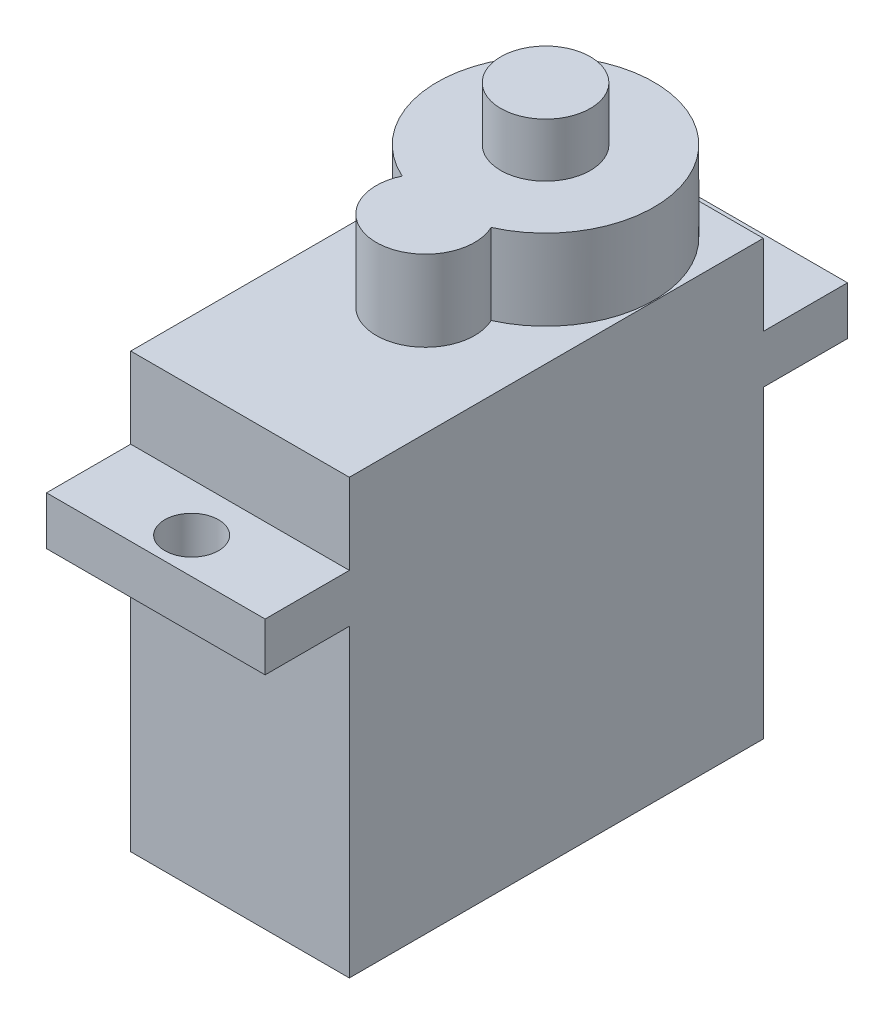
ISO-10303-21;
HEADER;
FILE_DESCRIPTION(('STEP AP214'),'2;1');
FILE_NAME('part.step','',(''),(''),'','','');
FILE_SCHEMA(('AUTOMOTIVE_DESIGN { 1 0 10303 214 1 1 1 1 }'));
ENDSEC;
DATA;
#1=APPLICATION_CONTEXT('core data for automotive mechanical design processes');
#2=APPLICATION_PROTOCOL_DEFINITION('international standard','automotive_design',2000,#1);
#3=PRODUCT_CONTEXT('',#1,'mechanical');
#4=PRODUCT('Part','Part','',(#3));
#5=PRODUCT_RELATED_PRODUCT_CATEGORY('part','',(#4));
#6=PRODUCT_DEFINITION_FORMATION('','',#4);
#7=PRODUCT_DEFINITION_CONTEXT('part definition',#1,'design');
#8=PRODUCT_DEFINITION('design','',#6,#7);
#9=PRODUCT_DEFINITION_SHAPE('','',#8);
#10=(LENGTH_UNIT() NAMED_UNIT(*) SI_UNIT(.MILLI.,.METRE.));
#11=(NAMED_UNIT(*) PLANE_ANGLE_UNIT() SI_UNIT($,.RADIAN.));
#12=(NAMED_UNIT(*) SI_UNIT($,.STERADIAN.) SOLID_ANGLE_UNIT());
#13=UNCERTAINTY_MEASURE_WITH_UNIT(LENGTH_MEASURE(1.E-05),#10,'distance_accuracy_value','');
#14=(GEOMETRIC_REPRESENTATION_CONTEXT(3) GLOBAL_UNCERTAINTY_ASSIGNED_CONTEXT((#13)) GLOBAL_UNIT_ASSIGNED_CONTEXT((#10,
#11,#12)) REPRESENTATION_CONTEXT('',''));
#15=CARTESIAN_POINT('',(0.,0.,0.));
#16=DIRECTION('',(0.,0.,1.));
#17=DIRECTION('',(1.,0.,0.));
#18=AXIS2_PLACEMENT_3D('',#15,#16,#17);
#19=CARTESIAN_POINT('',(-6.1,24.2,-11.55));
#20=DIRECTION('',(0.,0.,1.));
#21=DIRECTION('',(1.,0.,0.));
#22=AXIS2_PLACEMENT_3D('',#19,#20,#21);
#23=PLANE('',#22);
#24=DIRECTION('',(0.,-1.,0.));
#25=VECTOR('',#24,1.);
#26=CARTESIAN_POINT('',(6.1,24.2,-11.55));
#27=LINE('',#26,#25);
#28=CARTESIAN_POINT('',(6.1,24.2,-11.55));
#29=VERTEX_POINT('',#28);
#30=CARTESIAN_POINT('',(6.09999999999999,19.7,-11.55));
#31=VERTEX_POINT('',#30);
#32=EDGE_CURVE('E264',#29,#31,#27,.T.);
#33=ORIENTED_EDGE('',*,*,#32,.T.);
#34=DIRECTION('',(-1.,0.,0.));
#35=VECTOR('',#34,1.);
#36=CARTESIAN_POINT('',(-6.09999999999999,19.7,-11.55));
#37=LINE('',#36,#35);
#38=CARTESIAN_POINT('',(-6.09999999999999,19.7,-11.55));
#39=VERTEX_POINT('',#38);
#40=EDGE_CURVE('E179',#31,#39,#37,.T.);
#41=ORIENTED_EDGE('',*,*,#40,.T.);
#42=DIRECTION('',(0.,-1.,0.));
#43=VECTOR('',#42,1.);
#44=CARTESIAN_POINT('',(-6.1,24.2,-11.55));
#45=LINE('',#44,#43);
#46=CARTESIAN_POINT('',(-6.1,24.2,-11.55));
#47=VERTEX_POINT('',#46);
#48=EDGE_CURVE('E261',#47,#39,#45,.T.);
#49=ORIENTED_EDGE('',*,*,#48,.F.);
#50=DIRECTION('',(-1.,0.,0.));
#51=VECTOR('',#50,1.);
#52=CARTESIAN_POINT('',(-6.1,24.2,-11.55));
#53=LINE('',#52,#51);
#54=CARTESIAN_POINT('',(0.,24.2,-11.55));
#55=VERTEX_POINT('',#54);
#56=EDGE_CURVE('E234',#55,#47,#53,.T.);
#57=ORIENTED_EDGE('',*,*,#56,.F.);
#58=EDGE_CURVE('E236',#29,#55,#53,.T.);
#59=ORIENTED_EDGE('',*,*,#58,.F.);
#60=EDGE_LOOP('',(#33,#41,#49,#57,#59));
#61=FACE_BOUND('',#60,.T.);
#62=ADVANCED_FACE('F45',(#61),#23,.F.);
#63=CARTESIAN_POINT('',(-6.1,24.2,11.55));
#64=DIRECTION('',(0.,0.,-1.));
#65=DIRECTION('',(-1.,0.,0.));
#66=AXIS2_PLACEMENT_3D('',#63,#64,#65);
#67=PLANE('',#66);
#68=DIRECTION('',(1.,0.,0.));
#69=VECTOR('',#68,1.);
#70=CARTESIAN_POINT('',(-6.1,17.,11.55));
#71=LINE('',#70,#69);
#72=CARTESIAN_POINT('',(-6.1,17.,11.55));
#73=VERTEX_POINT('',#72);
#74=CARTESIAN_POINT('',(6.1,17.,11.55));
#75=VERTEX_POINT('',#74);
#76=EDGE_CURVE('E207',#73,#75,#71,.T.);
#77=ORIENTED_EDGE('',*,*,#76,.F.);
#78=DIRECTION('',(0.,-1.,0.));
#79=VECTOR('',#78,1.);
#80=CARTESIAN_POINT('',(-6.1,24.2,11.55));
#81=LINE('',#80,#79);
#82=CARTESIAN_POINT('',(-6.1,0.,11.55));
#83=VERTEX_POINT('',#82);
#84=EDGE_CURVE('E257',#73,#83,#81,.T.);
#85=ORIENTED_EDGE('',*,*,#84,.T.);
#86=DIRECTION('',(1.,0.,0.));
#87=VECTOR('',#86,1.);
#88=CARTESIAN_POINT('',(-6.1,0.,11.55));
#89=LINE('',#88,#87);
#90=CARTESIAN_POINT('',(6.1,0.,11.55));
#91=VERTEX_POINT('',#90);
#92=EDGE_CURVE('E235',#83,#91,#89,.T.);
#93=ORIENTED_EDGE('',*,*,#92,.T.);
#94=DIRECTION('',(0.,-1.,0.));
#95=VECTOR('',#94,1.);
#96=CARTESIAN_POINT('',(6.1,24.2,11.55));
#97=LINE('',#96,#95);
#98=EDGE_CURVE('E243',#75,#91,#97,.T.);
#99=ORIENTED_EDGE('',*,*,#98,.F.);
#100=EDGE_LOOP('',(#77,#85,#93,#99));
#101=FACE_BOUND('',#100,.T.);
#102=ADVANCED_FACE('F285',(#101),#67,.F.);
#103=DIRECTION('',(-1.,0.,0.));
#104=VECTOR('',#103,1.);
#105=CARTESIAN_POINT('',(-6.09999999999999,19.7,11.55));
#106=LINE('',#105,#104);
#107=CARTESIAN_POINT('',(6.1,19.7,11.55));
#108=VERTEX_POINT('',#107);
#109=CARTESIAN_POINT('',(-6.09999999999999,19.7,11.55));
#110=VERTEX_POINT('',#109);
#111=EDGE_CURVE('E214',#108,#110,#106,.T.);
#112=ORIENTED_EDGE('',*,*,#111,.F.);
#113=CARTESIAN_POINT('',(6.1,24.2,11.55));
#114=VERTEX_POINT('',#113);
#115=EDGE_CURVE('E254',#114,#108,#97,.T.);
#116=ORIENTED_EDGE('',*,*,#115,.F.);
#117=DIRECTION('',(1.,0.,0.));
#118=VECTOR('',#117,1.);
#119=CARTESIAN_POINT('',(-6.1,24.2,11.55));
#120=LINE('',#119,#118);
#121=CARTESIAN_POINT('',(-6.1,24.2,11.55));
#122=VERTEX_POINT('',#121);
#123=EDGE_CURVE('E241',#122,#114,#120,.T.);
#124=ORIENTED_EDGE('',*,*,#123,.F.);
#125=EDGE_CURVE('E258',#122,#110,#81,.T.);
#126=ORIENTED_EDGE('',*,*,#125,.T.);
#127=EDGE_LOOP('',(#112,#116,#124,#126));
#128=FACE_BOUND('',#127,.T.);
#129=ADVANCED_FACE('F309',(#128),#67,.F.);
#130=CARTESIAN_POINT('',(6.1,24.2,11.55));
#131=DIRECTION('',(-1.,0.,0.));
#132=DIRECTION('',(0.,0.,1.));
#133=AXIS2_PLACEMENT_3D('',#130,#131,#132);
#134=PLANE('',#133);
#135=DIRECTION('',(0.,0.,-1.));
#136=VECTOR('',#135,1.);
#137=CARTESIAN_POINT('',(6.1,0.,11.55));
#138=LINE('',#137,#136);
#139=CARTESIAN_POINT('',(6.1,0.,-11.55));
#140=VERTEX_POINT('',#139);
#141=EDGE_CURVE('E230',#91,#140,#138,.T.);
#142=ORIENTED_EDGE('',*,*,#141,.T.);
#143=CARTESIAN_POINT('',(6.1,17.,-11.55));
#144=VERTEX_POINT('',#143);
#145=EDGE_CURVE('E263',#144,#140,#27,.T.);
#146=ORIENTED_EDGE('',*,*,#145,.F.);
#147=DIRECTION('',(0.,0.,1.));
#148=VECTOR('',#147,1.);
#149=CARTESIAN_POINT('',(6.1,17.,-16.25));
#150=LINE('',#149,#148);
#151=CARTESIAN_POINT('',(6.1,17.,-16.25));
#152=VERTEX_POINT('',#151);
#153=EDGE_CURVE('E198',#152,#144,#150,.T.);
#154=ORIENTED_EDGE('',*,*,#153,.F.);
#155=DIRECTION('',(0.,1.,0.));
#156=VECTOR('',#155,1.);
#157=CARTESIAN_POINT('',(6.1,17.,-16.25));
#158=LINE('',#157,#156);
#159=CARTESIAN_POINT('',(6.09999999999999,19.7,-16.25));
#160=VERTEX_POINT('',#159);
#161=EDGE_CURVE('E175',#152,#160,#158,.T.);
#162=ORIENTED_EDGE('',*,*,#161,.T.);
#163=DIRECTION('',(0.,0.,1.));
#164=VECTOR('',#163,1.);
#165=CARTESIAN_POINT('',(6.09999999999999,19.7,-16.25));
#166=LINE('',#165,#164);
#167=EDGE_CURVE('E188',#160,#31,#166,.T.);
#168=ORIENTED_EDGE('',*,*,#167,.T.);
#169=ORIENTED_EDGE('',*,*,#32,.F.);
#170=DIRECTION('',(0.,0.,-1.));
#171=VECTOR('',#170,1.);
#172=CARTESIAN_POINT('',(6.1,24.2,11.55));
#173=LINE('',#172,#171);
#174=EDGE_CURVE('E231',#114,#29,#173,.T.);
#175=ORIENTED_EDGE('',*,*,#174,.F.);
#176=ORIENTED_EDGE('',*,*,#115,.T.);
#177=DIRECTION('',(0.,0.,-1.));
#178=VECTOR('',#177,1.);
#179=CARTESIAN_POINT('',(6.09999999999999,19.7,16.25));
#180=LINE('',#179,#178);
#181=CARTESIAN_POINT('',(6.09999999999999,19.7,16.25));
#182=VERTEX_POINT('',#181);
#183=EDGE_CURVE('E227',#182,#108,#180,.T.);
#184=ORIENTED_EDGE('',*,*,#183,.F.);
#185=DIRECTION('',(0.,1.,0.));
#186=VECTOR('',#185,1.);
#187=CARTESIAN_POINT('',(6.1,17.,16.25));
#188=LINE('',#187,#186);
#189=CARTESIAN_POINT('',(6.1,17.,16.25));
#190=VERTEX_POINT('',#189);
#191=EDGE_CURVE('E203',#190,#182,#188,.T.);
#192=ORIENTED_EDGE('',*,*,#191,.F.);
#193=DIRECTION('',(0.,0.,-1.));
#194=VECTOR('',#193,1.);
#195=CARTESIAN_POINT('',(6.1,17.,16.25));
#196=LINE('',#195,#194);
#197=EDGE_CURVE('E213',#190,#75,#196,.T.);
#198=ORIENTED_EDGE('',*,*,#197,.T.);
#199=ORIENTED_EDGE('',*,*,#98,.T.);
#200=EDGE_LOOP('',(#142,#146,#154,#162,#168,#169,#175,#176,#184,#192,#198,#199));
#201=FACE_BOUND('',#200,.T.);
#202=ADVANCED_FACE('F47',(#201),#134,.F.);
#203=CARTESIAN_POINT('',(-6.1,17.,-11.55));
#204=VERTEX_POINT('',#203);
#205=CARTESIAN_POINT('',(-6.1,0.,-11.55));
#206=VERTEX_POINT('',#205);
#207=EDGE_CURVE('E260',#204,#206,#45,.T.);
#208=ORIENTED_EDGE('',*,*,#207,.F.);
#209=DIRECTION('',(1.,0.,0.));
#210=VECTOR('',#209,1.);
#211=CARTESIAN_POINT('',(-6.1,17.,-11.55));
#212=LINE('',#211,#210);
#213=EDGE_CURVE('E174',#204,#144,#212,.T.);
#214=ORIENTED_EDGE('',*,*,#213,.T.);
#215=ORIENTED_EDGE('',*,*,#145,.T.);
#216=DIRECTION('',(-1.,0.,0.));
#217=VECTOR('',#216,1.);
#218=CARTESIAN_POINT('',(-6.1,0.,-11.55));
#219=LINE('',#218,#217);
#220=EDGE_CURVE('E246',#140,#206,#219,.T.);
#221=ORIENTED_EDGE('',*,*,#220,.T.);
#222=EDGE_LOOP('',(#208,#214,#215,#221));
#223=FACE_BOUND('',#222,.T.);
#224=ADVANCED_FACE('F274',(#223),#23,.F.);
#225=CARTESIAN_POINT('',(-6.1,24.2,11.55));
#226=DIRECTION('',(1.,0.,0.));
#227=DIRECTION('',(0.,0.,-1.));
#228=AXIS2_PLACEMENT_3D('',#225,#226,#227);
#229=PLANE('',#228);
#230=DIRECTION('',(0.,0.,1.));
#231=VECTOR('',#230,1.);
#232=CARTESIAN_POINT('',(-6.1,0.,11.55));
#233=LINE('',#232,#231);
#234=EDGE_CURVE('E249',#206,#83,#233,.T.);
#235=ORIENTED_EDGE('',*,*,#234,.T.);
#236=ORIENTED_EDGE('',*,*,#84,.F.);
#237=DIRECTION('',(0.,0.,-1.));
#238=VECTOR('',#237,1.);
#239=CARTESIAN_POINT('',(-6.1,17.,16.25));
#240=LINE('',#239,#238);
#241=CARTESIAN_POINT('',(-6.1,17.,16.25));
#242=VERTEX_POINT('',#241);
#243=EDGE_CURVE('E221',#242,#73,#240,.T.);
#244=ORIENTED_EDGE('',*,*,#243,.F.);
#245=DIRECTION('',(0.,-1.,0.));
#246=VECTOR('',#245,1.);
#247=CARTESIAN_POINT('',(-6.09999999999999,19.7,16.25));
#248=LINE('',#247,#246);
#249=CARTESIAN_POINT('',(-6.09999999999999,19.7,16.25));
#250=VERTEX_POINT('',#249);
#251=EDGE_CURVE('E209',#250,#242,#248,.T.);
#252=ORIENTED_EDGE('',*,*,#251,.F.);
#253=DIRECTION('',(0.,0.,-1.));
#254=VECTOR('',#253,1.);
#255=CARTESIAN_POINT('',(-6.09999999999999,19.7,16.25));
#256=LINE('',#255,#254);
#257=EDGE_CURVE('E224',#250,#110,#256,.T.);
#258=ORIENTED_EDGE('',*,*,#257,.T.);
#259=ORIENTED_EDGE('',*,*,#125,.F.);
#260=DIRECTION('',(0.,0.,1.));
#261=VECTOR('',#260,1.);
#262=CARTESIAN_POINT('',(-6.1,24.2,11.55));
#263=LINE('',#262,#261);
#264=EDGE_CURVE('E239',#47,#122,#263,.T.);
#265=ORIENTED_EDGE('',*,*,#264,.F.);
#266=ORIENTED_EDGE('',*,*,#48,.T.);
#267=DIRECTION('',(0.,0.,1.));
#268=VECTOR('',#267,1.);
#269=CARTESIAN_POINT('',(-6.09999999999999,19.7,-16.25));
#270=LINE('',#269,#268);
#271=CARTESIAN_POINT('',(-6.09999999999999,19.7,-16.25));
#272=VERTEX_POINT('',#271);
#273=EDGE_CURVE('E194',#272,#39,#270,.T.);
#274=ORIENTED_EDGE('',*,*,#273,.F.);
#275=DIRECTION('',(0.,-1.,0.));
#276=VECTOR('',#275,1.);
#277=CARTESIAN_POINT('',(-6.09999999999999,19.7,-16.25));
#278=LINE('',#277,#276);
#279=CARTESIAN_POINT('',(-6.1,17.,-16.25));
#280=VERTEX_POINT('',#279);
#281=EDGE_CURVE('E182',#272,#280,#278,.T.);
#282=ORIENTED_EDGE('',*,*,#281,.T.);
#283=DIRECTION('',(0.,0.,1.));
#284=VECTOR('',#283,1.);
#285=CARTESIAN_POINT('',(-6.1,17.,-16.25));
#286=LINE('',#285,#284);
#287=EDGE_CURVE('E196',#280,#204,#286,.T.);
#288=ORIENTED_EDGE('',*,*,#287,.T.);
#289=ORIENTED_EDGE('',*,*,#207,.T.);
#290=EDGE_LOOP('',(#235,#236,#244,#252,#258,#259,#265,#266,#274,#282,#288,#289));
#291=FACE_BOUND('',#290,.T.);
#292=ADVANCED_FACE('F289',(#291),#229,.F.);
#293=CARTESIAN_POINT('',(0.,24.2,0.));
#294=DIRECTION('',(0.,-1.,0.));
#295=DIRECTION('',(0.,0.,-1.));
#296=AXIS2_PLACEMENT_3D('',#293,#294,#295);
#297=PLANE('',#296);
#298=CARTESIAN_POINT('',(0.,24.2,-5.5));
#299=DIRECTION('',(0.,1.,0.));
#300=DIRECTION('',(0.,0.,1.));
#301=AXIS2_PLACEMENT_3D('',#298,#299,#300);
#302=CIRCLE('',#301,6.05);
#303=CARTESIAN_POINT('',(2.48261946757984,24.2,0.0171641791044796));
#304=VERTEX_POINT('',#303);
#305=EDGE_CURVE('E269',#304,#55,#302,.T.);
#306=ORIENTED_EDGE('',*,*,#305,.F.);
#307=CARTESIAN_POINT('',(0.,24.2,1.2));
#308=DIRECTION('',(0.,1.,0.));
#309=DIRECTION('',(0.,0.,1.));
#310=AXIS2_PLACEMENT_3D('',#307,#308,#309);
#311=CIRCLE('',#310,2.75);
#312=CARTESIAN_POINT('',(-2.48261946757984,24.2,0.0171641791044752));
#313=VERTEX_POINT('',#312);
#314=EDGE_CURVE('E62',#313,#304,#311,.T.);
#315=ORIENTED_EDGE('',*,*,#314,.F.);
#316=EDGE_CURVE('E54',#55,#313,#302,.T.);
#317=ORIENTED_EDGE('',*,*,#316,.F.);
#318=ORIENTED_EDGE('',*,*,#56,.T.);
#319=ORIENTED_EDGE('',*,*,#264,.T.);
#320=ORIENTED_EDGE('',*,*,#123,.T.);
#321=ORIENTED_EDGE('',*,*,#174,.T.);
#322=ORIENTED_EDGE('',*,*,#58,.T.);
#323=EDGE_LOOP('',(#306,#315,#317,#318,#319,#320,#321,#322));
#324=FACE_BOUND('',#323,.T.);
#325=ADVANCED_FACE('F304',(#324),#297,.F.);
#326=CARTESIAN_POINT('',(0.,0.,0.));
#327=DIRECTION('',(0.,-1.,0.));
#328=DIRECTION('',(0.,0.,-1.));
#329=AXIS2_PLACEMENT_3D('',#326,#327,#328);
#330=PLANE('',#329);
#331=ORIENTED_EDGE('',*,*,#141,.F.);
#332=ORIENTED_EDGE('',*,*,#92,.F.);
#333=ORIENTED_EDGE('',*,*,#234,.F.);
#334=ORIENTED_EDGE('',*,*,#220,.F.);
#335=EDGE_LOOP('',(#331,#332,#333,#334));
#336=FACE_BOUND('',#335,.T.);
#337=ADVANCED_FACE('F280',(#336),#330,.T.);
#338=CARTESIAN_POINT('',(-6.09999999999999,19.7,16.25));
#339=DIRECTION('',(0.,-1.,0.));
#340=DIRECTION('',(0.,0.,-1.));
#341=AXIS2_PLACEMENT_3D('',#338,#339,#340);
#342=PLANE('',#341);
#343=CARTESIAN_POINT('',(0.,19.7,14.25));
#344=DIRECTION('',(0.,1.,0.));
#345=DIRECTION('',(0.,0.,1.));
#346=AXIS2_PLACEMENT_3D('',#343,#344,#345);
#347=CIRCLE('',#346,1.5);
#348=CARTESIAN_POINT('',(0.,19.7,15.75));
#349=VERTEX_POINT('',#348);
#350=EDGE_CURVE('E200',#349,#349,#347,.T.);
#351=ORIENTED_EDGE('',*,*,#350,.F.);
#352=EDGE_LOOP('',(#351));
#353=FACE_BOUND('',#352,.T.);
#354=ORIENTED_EDGE('',*,*,#111,.T.);
#355=ORIENTED_EDGE('',*,*,#257,.F.);
#356=DIRECTION('',(-1.,0.,0.));
#357=VECTOR('',#356,1.);
#358=CARTESIAN_POINT('',(-6.09999999999999,19.7,16.25));
#359=LINE('',#358,#357);
#360=EDGE_CURVE('E206',#182,#250,#359,.T.);
#361=ORIENTED_EDGE('',*,*,#360,.F.);
#362=ORIENTED_EDGE('',*,*,#183,.T.);
#363=EDGE_LOOP('',(#354,#355,#361,#362));
#364=FACE_BOUND('',#363,.T.);
#365=ADVANCED_FACE('F312',(#353,#364),#342,.F.);
#366=CARTESIAN_POINT('',(-6.1,17.,16.25));
#367=DIRECTION('',(0.,1.,0.));
#368=DIRECTION('',(0.,0.,1.));
#369=AXIS2_PLACEMENT_3D('',#366,#367,#368);
#370=PLANE('',#369);
#371=CARTESIAN_POINT('',(0.,17.,14.25));
#372=DIRECTION('',(0.,1.,0.));
#373=DIRECTION('',(0.,0.,1.));
#374=AXIS2_PLACEMENT_3D('',#371,#372,#373);
#375=CIRCLE('',#374,1.5);
#376=CARTESIAN_POINT('',(0.,17.,15.75));
#377=VERTEX_POINT('',#376);
#378=EDGE_CURVE('E49',#377,#377,#375,.T.);
#379=ORIENTED_EDGE('',*,*,#378,.T.);
#380=EDGE_LOOP('',(#379));
#381=FACE_BOUND('',#380,.T.);
#382=ORIENTED_EDGE('',*,*,#76,.T.);
#383=ORIENTED_EDGE('',*,*,#197,.F.);
#384=DIRECTION('',(1.,0.,0.));
#385=VECTOR('',#384,1.);
#386=CARTESIAN_POINT('',(-6.1,17.,16.25));
#387=LINE('',#386,#385);
#388=EDGE_CURVE('E211',#242,#190,#387,.T.);
#389=ORIENTED_EDGE('',*,*,#388,.F.);
#390=ORIENTED_EDGE('',*,*,#243,.T.);
#391=EDGE_LOOP('',(#382,#383,#389,#390));
#392=FACE_BOUND('',#391,.T.);
#393=ADVANCED_FACE('F318',(#381,#392),#370,.F.);
#394=CARTESIAN_POINT('',(0.,0.,16.25));
#395=DIRECTION('',(0.,0.,-1.));
#396=DIRECTION('',(-1.,0.,0.));
#397=AXIS2_PLACEMENT_3D('',#394,#395,#396);
#398=PLANE('',#397);
#399=ORIENTED_EDGE('',*,*,#191,.T.);
#400=ORIENTED_EDGE('',*,*,#360,.T.);
#401=ORIENTED_EDGE('',*,*,#251,.T.);
#402=ORIENTED_EDGE('',*,*,#388,.T.);
#403=EDGE_LOOP('',(#399,#400,#401,#402));
#404=FACE_BOUND('',#403,.T.);
#405=ADVANCED_FACE('F316',(#404),#398,.F.);
#406=CARTESIAN_POINT('',(0.,0.,14.25));
#407=DIRECTION('',(0.,1.,0.));
#408=DIRECTION('',(0.,0.,1.));
#409=AXIS2_PLACEMENT_3D('',#406,#407,#408);
#410=CYLINDRICAL_SURFACE('',#409,1.5);
#411=ORIENTED_EDGE('',*,*,#350,.T.);
#412=EDGE_LOOP('',(#411));
#413=FACE_BOUND('',#412,.T.);
#414=ORIENTED_EDGE('',*,*,#378,.F.);
#415=EDGE_LOOP('',(#414));
#416=FACE_BOUND('',#415,.T.);
#417=ADVANCED_FACE('F327',(#413,#416),#410,.F.);
#418=CARTESIAN_POINT('',(-6.1,17.,-16.25));
#419=DIRECTION('',(0.,-1.,0.));
#420=DIRECTION('',(0.,0.,-1.));
#421=AXIS2_PLACEMENT_3D('',#418,#419,#420);
#422=PLANE('',#421);
#423=CARTESIAN_POINT('',(0.,17.,-14.25));
#424=DIRECTION('',(0.,-1.,0.));
#425=DIRECTION('',(0.,0.,-1.));
#426=AXIS2_PLACEMENT_3D('',#423,#424,#425);
#427=CIRCLE('',#426,1.5);
#428=CARTESIAN_POINT('',(0.,17.,-15.75));
#429=VERTEX_POINT('',#428);
#430=EDGE_CURVE('E167',#429,#429,#427,.F.);
#431=ORIENTED_EDGE('',*,*,#430,.T.);
#432=EDGE_LOOP('',(#431));
#433=FACE_BOUND('',#432,.T.);
#434=ORIENTED_EDGE('',*,*,#213,.F.);
#435=ORIENTED_EDGE('',*,*,#287,.F.);
#436=DIRECTION('',(1.,0.,0.));
#437=VECTOR('',#436,1.);
#438=CARTESIAN_POINT('',(-6.1,17.,-16.25));
#439=LINE('',#438,#437);
#440=EDGE_CURVE('E178',#280,#152,#439,.T.);
#441=ORIENTED_EDGE('',*,*,#440,.T.);
#442=ORIENTED_EDGE('',*,*,#153,.T.);
#443=EDGE_LOOP('',(#434,#435,#441,#442));
#444=FACE_BOUND('',#443,.T.);
#445=ADVANCED_FACE('F293',(#433,#444),#422,.T.);
#446=CARTESIAN_POINT('',(-6.09999999999999,19.7,-16.25));
#447=DIRECTION('',(0.,1.,0.));
#448=DIRECTION('',(0.,0.,1.));
#449=AXIS2_PLACEMENT_3D('',#446,#447,#448);
#450=PLANE('',#449);
#451=CARTESIAN_POINT('',(0.,19.7,-14.25));
#452=DIRECTION('',(0.,-1.,0.));
#453=DIRECTION('',(0.,0.,-1.));
#454=AXIS2_PLACEMENT_3D('',#451,#452,#453);
#455=CIRCLE('',#454,1.5);
#456=CARTESIAN_POINT('',(0.,19.7,-15.75));
#457=VERTEX_POINT('',#456);
#458=EDGE_CURVE('E164',#457,#457,#455,.T.);
#459=ORIENTED_EDGE('',*,*,#458,.T.);
#460=EDGE_LOOP('',(#459));
#461=FACE_BOUND('',#460,.T.);
#462=ORIENTED_EDGE('',*,*,#40,.F.);
#463=ORIENTED_EDGE('',*,*,#167,.F.);
#464=DIRECTION('',(-1.,0.,0.));
#465=VECTOR('',#464,1.);
#466=CARTESIAN_POINT('',(-6.09999999999999,19.7,-16.25));
#467=LINE('',#466,#465);
#468=EDGE_CURVE('E185',#160,#272,#467,.T.);
#469=ORIENTED_EDGE('',*,*,#468,.T.);
#470=ORIENTED_EDGE('',*,*,#273,.T.);
#471=EDGE_LOOP('',(#462,#463,#469,#470));
#472=FACE_BOUND('',#471,.T.);
#473=ADVANCED_FACE('F300',(#461,#472),#450,.T.);
#474=CARTESIAN_POINT('',(0.,0.,-16.25));
#475=DIRECTION('',(0.,0.,1.));
#476=DIRECTION('',(-1.,0.,0.));
#477=AXIS2_PLACEMENT_3D('',#474,#475,#476);
#478=PLANE('',#477);
#479=ORIENTED_EDGE('',*,*,#161,.F.);
#480=ORIENTED_EDGE('',*,*,#440,.F.);
#481=ORIENTED_EDGE('',*,*,#281,.F.);
#482=ORIENTED_EDGE('',*,*,#468,.F.);
#483=EDGE_LOOP('',(#479,#480,#481,#482));
#484=FACE_BOUND('',#483,.T.);
#485=ADVANCED_FACE('F297',(#484),#478,.F.);
#486=CARTESIAN_POINT('',(0.,0.,-14.25));
#487=DIRECTION('',(0.,1.,0.));
#488=DIRECTION('',(0.,0.,1.));
#489=AXIS2_PLACEMENT_3D('',#486,#487,#488);
#490=CYLINDRICAL_SURFACE('',#489,1.5);
#491=ORIENTED_EDGE('',*,*,#430,.F.);
#492=EDGE_LOOP('',(#491));
#493=FACE_BOUND('',#492,.T.);
#494=ORIENTED_EDGE('',*,*,#458,.F.);
#495=EDGE_LOOP('',(#494));
#496=FACE_BOUND('',#495,.T.);
#497=ADVANCED_FACE('F364',(#493,#496),#490,.F.);
#498=CARTESIAN_POINT('',(0.,28.7,-5.5));
#499=DIRECTION('',(0.,-1.,0.));
#500=DIRECTION('',(0.,0.,-1.));
#501=AXIS2_PLACEMENT_3D('',#498,#499,#500);
#502=CYLINDRICAL_SURFACE('',#501,6.05);
#503=ORIENTED_EDGE('',*,*,#305,.T.);
#504=ORIENTED_EDGE('',*,*,#316,.T.);
#505=DIRECTION('',(0.,-1.,0.));
#506=VECTOR('',#505,1.);
#507=CARTESIAN_POINT('',(-2.48261946757984,28.7,0.0171641791044752));
#508=LINE('',#507,#506);
#509=CARTESIAN_POINT('',(-2.48261946757984,28.7,0.0171641791044752));
#510=VERTEX_POINT('',#509);
#511=EDGE_CURVE('E152',#510,#313,#508,.T.);
#512=ORIENTED_EDGE('',*,*,#511,.F.);
#513=CARTESIAN_POINT('',(0.,28.7,-5.5));
#514=DIRECTION('',(0.,1.,0.));
#515=DIRECTION('',(0.,0.,1.));
#516=AXIS2_PLACEMENT_3D('',#513,#514,#515);
#517=CIRCLE('',#516,6.05);
#518=CARTESIAN_POINT('',(2.48261946757984,28.7,0.0171641791044796));
#519=VERTEX_POINT('',#518);
#520=EDGE_CURVE('E157',#519,#510,#517,.T.);
#521=ORIENTED_EDGE('',*,*,#520,.F.);
#522=DIRECTION('',(0.,-1.,0.));
#523=VECTOR('',#522,1.);
#524=CARTESIAN_POINT('',(2.48261946757984,28.7,0.0171641791044796));
#525=LINE('',#524,#523);
#526=EDGE_CURVE('E154',#519,#304,#525,.T.);
#527=ORIENTED_EDGE('',*,*,#526,.T.);
#528=EDGE_LOOP('',(#503,#504,#512,#521,#527));
#529=FACE_BOUND('',#528,.T.);
#530=ADVANCED_FACE('F163',(#529),#502,.T.);
#531=CARTESIAN_POINT('',(0.,28.7,1.2));
#532=DIRECTION('',(0.,-1.,0.));
#533=DIRECTION('',(0.,0.,-1.));
#534=AXIS2_PLACEMENT_3D('',#531,#532,#533);
#535=CYLINDRICAL_SURFACE('',#534,2.75);
#536=ORIENTED_EDGE('',*,*,#314,.T.);
#537=ORIENTED_EDGE('',*,*,#526,.F.);
#538=CARTESIAN_POINT('',(0.,28.7,1.2));
#539=DIRECTION('',(0.,1.,0.));
#540=DIRECTION('',(0.,0.,1.));
#541=AXIS2_PLACEMENT_3D('',#538,#539,#540);
#542=CIRCLE('',#541,2.75);
#543=EDGE_CURVE('E148',#510,#519,#542,.T.);
#544=ORIENTED_EDGE('',*,*,#543,.F.);
#545=ORIENTED_EDGE('',*,*,#511,.T.);
#546=EDGE_LOOP('',(#536,#537,#544,#545));
#547=FACE_BOUND('',#546,.T.);
#548=ADVANCED_FACE('F150',(#547),#535,.T.);
#549=CARTESIAN_POINT('',(0.,28.7,0.));
#550=DIRECTION('',(0.,1.,0.));
#551=DIRECTION('',(0.,0.,1.));
#552=AXIS2_PLACEMENT_3D('',#549,#550,#551);
#553=PLANE('',#552);
#554=CARTESIAN_POINT('',(0.,28.7,-5.5));
#555=DIRECTION('',(0.,1.,0.));
#556=DIRECTION('',(0.,0.,1.));
#557=AXIS2_PLACEMENT_3D('',#554,#555,#556);
#558=CIRCLE('',#557,2.5);
#559=CARTESIAN_POINT('',(0.,28.7,-3.));
#560=VERTEX_POINT('',#559);
#561=EDGE_CURVE('E11',#560,#560,#558,.T.);
#562=ORIENTED_EDGE('',*,*,#561,.F.);
#563=EDGE_LOOP('',(#562));
#564=FACE_BOUND('',#563,.T.);
#565=ORIENTED_EDGE('',*,*,#520,.T.);
#566=ORIENTED_EDGE('',*,*,#543,.T.);
#567=EDGE_LOOP('',(#565,#566));
#568=FACE_BOUND('',#567,.T.);
#569=ADVANCED_FACE('F159',(#564,#568),#553,.T.);
#570=CARTESIAN_POINT('',(0.,31.7,-5.5));
#571=DIRECTION('',(0.,-1.,0.));
#572=DIRECTION('',(0.,0.,-1.));
#573=AXIS2_PLACEMENT_3D('',#570,#571,#572);
#574=CYLINDRICAL_SURFACE('',#573,2.5);
#575=CARTESIAN_POINT('',(0.,31.7,-5.5));
#576=DIRECTION('',(0.,1.,0.));
#577=DIRECTION('',(0.,0.,1.));
#578=AXIS2_PLACEMENT_3D('',#575,#576,#577);
#579=CIRCLE('',#578,2.5);
#580=CARTESIAN_POINT('',(0.,31.7,-3.));
#581=VERTEX_POINT('',#580);
#582=EDGE_CURVE('E520',#581,#581,#579,.T.);
#583=ORIENTED_EDGE('',*,*,#582,.F.);
#584=EDGE_LOOP('',(#583));
#585=FACE_BOUND('',#584,.T.);
#586=ORIENTED_EDGE('',*,*,#561,.T.);
#587=EDGE_LOOP('',(#586));
#588=FACE_BOUND('',#587,.T.);
#589=ADVANCED_FACE('F381',(#585,#588),#574,.T.);
#590=CARTESIAN_POINT('',(0.,31.7,-5.5));
#591=DIRECTION('',(0.,1.,0.));
#592=DIRECTION('',(0.,0.,1.));
#593=AXIS2_PLACEMENT_3D('',#590,#591,#592);
#594=PLANE('',#593);
#595=ORIENTED_EDGE('',*,*,#582,.T.);
#596=EDGE_LOOP('',(#595));
#597=FACE_BOUND('',#596,.T.);
#598=ADVANCED_FACE('F389',(#597),#594,.T.);
#599=CLOSED_SHELL('',(#62,#102,#129,#202,#224,#292,#325,#337,#365,#393,#405,#417,#445,#473,#485,
#497,#530,#548,#569,#589,#598));
#600=MANIFOLD_SOLID_BREP('B2',#599);
#601=ADVANCED_BREP_SHAPE_REPRESENTATION('',(#18,#600),#14);
#602=SHAPE_DEFINITION_REPRESENTATION(#9,#601);
ENDSEC;
END-ISO-10303-21;
